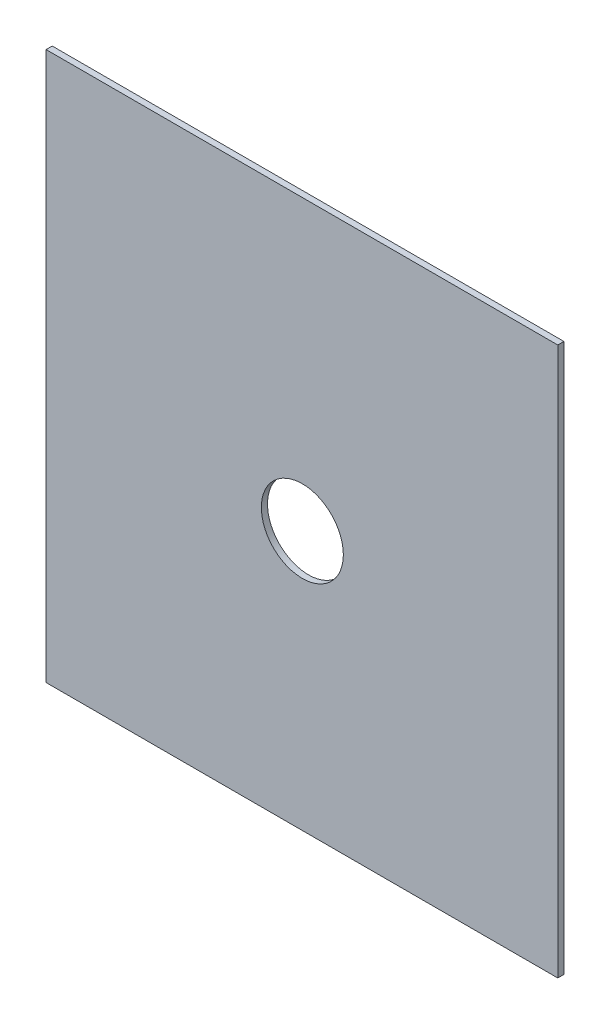
ISO-10303-21;
HEADER;
FILE_DESCRIPTION(('STEP AP214'),'2;1');
FILE_NAME('part.step','',(''),(''),'','','');
FILE_SCHEMA(('AUTOMOTIVE_DESIGN { 1 0 10303 214 1 1 1 1 }'));
ENDSEC;
DATA;
#1=APPLICATION_CONTEXT('core data for automotive mechanical design processes');
#2=APPLICATION_PROTOCOL_DEFINITION('international standard','automotive_design',2000,#1);
#3=PRODUCT_CONTEXT('',#1,'mechanical');
#4=PRODUCT('Part','Part','',(#3));
#5=PRODUCT_RELATED_PRODUCT_CATEGORY('part','',(#4));
#6=PRODUCT_DEFINITION_FORMATION('','',#4);
#7=PRODUCT_DEFINITION_CONTEXT('part definition',#1,'design');
#8=PRODUCT_DEFINITION('design','',#6,#7);
#9=PRODUCT_DEFINITION_SHAPE('','',#8);
#10=(LENGTH_UNIT() NAMED_UNIT(*) SI_UNIT(.MILLI.,.METRE.));
#11=(NAMED_UNIT(*) PLANE_ANGLE_UNIT() SI_UNIT($,.RADIAN.));
#12=(NAMED_UNIT(*) SI_UNIT($,.STERADIAN.) SOLID_ANGLE_UNIT());
#13=UNCERTAINTY_MEASURE_WITH_UNIT(LENGTH_MEASURE(1.E-05),#10,'distance_accuracy_value','');
#14=(GEOMETRIC_REPRESENTATION_CONTEXT(3) GLOBAL_UNCERTAINTY_ASSIGNED_CONTEXT((#13)) GLOBAL_UNIT_ASSIGNED_CONTEXT((#10,
#11,#12)) REPRESENTATION_CONTEXT('',''));
#15=CARTESIAN_POINT('',(0.,0.,0.));
#16=DIRECTION('',(0.,0.,1.));
#17=DIRECTION('',(1.,0.,0.));
#18=AXIS2_PLACEMENT_3D('',#15,#16,#17);
#19=CARTESIAN_POINT('',(0.,0.,3.));
#20=DIRECTION('',(1.,0.,0.));
#21=DIRECTION('',(0.,1.,0.));
#22=AXIS2_PLACEMENT_3D('',#19,#20,#21);
#23=PLANE('',#22);
#24=DIRECTION('',(0.,-1.,0.));
#25=VECTOR('',#24,1.);
#26=CARTESIAN_POINT('',(0.,0.,0.));
#27=LINE('',#26,#25);
#28=CARTESIAN_POINT('',(0.,0.,0.));
#29=VERTEX_POINT('',#28);
#30=CARTESIAN_POINT('',(0.,-267.4,0.));
#31=VERTEX_POINT('',#30);
#32=EDGE_CURVE('E96',#29,#31,#27,.T.);
#33=ORIENTED_EDGE('',*,*,#32,.T.);
#34=DIRECTION('',(0.,0.,-1.));
#35=VECTOR('',#34,1.);
#36=CARTESIAN_POINT('',(0.,-267.4,3.));
#37=LINE('',#36,#35);
#38=CARTESIAN_POINT('',(0.,-267.4,3.));
#39=VERTEX_POINT('',#38);
#40=EDGE_CURVE('E11',#39,#31,#37,.T.);
#41=ORIENTED_EDGE('',*,*,#40,.F.);
#42=DIRECTION('',(0.,-1.,0.));
#43=VECTOR('',#42,1.);
#44=CARTESIAN_POINT('',(0.,0.,3.));
#45=LINE('',#44,#43);
#46=CARTESIAN_POINT('',(0.,0.,3.));
#47=VERTEX_POINT('',#46);
#48=EDGE_CURVE('E84',#47,#39,#45,.T.);
#49=ORIENTED_EDGE('',*,*,#48,.F.);
#50=DIRECTION('',(0.,0.,-1.));
#51=VECTOR('',#50,1.);
#52=CARTESIAN_POINT('',(0.,0.,3.));
#53=LINE('',#52,#51);
#54=EDGE_CURVE('E92',#47,#29,#53,.T.);
#55=ORIENTED_EDGE('',*,*,#54,.T.);
#56=EDGE_LOOP('',(#33,#41,#49,#55));
#57=FACE_BOUND('',#56,.T.);
#58=ADVANCED_FACE('F33',(#57),#23,.F.);
#59=CARTESIAN_POINT('',(0.,-267.4,3.));
#60=DIRECTION('',(0.,1.,0.));
#61=DIRECTION('',(0.,0.,1.));
#62=AXIS2_PLACEMENT_3D('',#59,#60,#61);
#63=PLANE('',#62);
#64=DIRECTION('',(1.,0.,0.));
#65=VECTOR('',#64,1.);
#66=CARTESIAN_POINT('',(0.,-267.4,0.));
#67=LINE('',#66,#65);
#68=CARTESIAN_POINT('',(249.6,-267.4,0.));
#69=VERTEX_POINT('',#68);
#70=EDGE_CURVE('E88',#31,#69,#67,.T.);
#71=ORIENTED_EDGE('',*,*,#70,.T.);
#72=DIRECTION('',(0.,0.,-1.));
#73=VECTOR('',#72,1.);
#74=CARTESIAN_POINT('',(249.6,-267.4,3.));
#75=LINE('',#74,#73);
#76=CARTESIAN_POINT('',(249.6,-267.4,3.));
#77=VERTEX_POINT('',#76);
#78=EDGE_CURVE('E41',#77,#69,#75,.T.);
#79=ORIENTED_EDGE('',*,*,#78,.F.);
#80=DIRECTION('',(1.,0.,0.));
#81=VECTOR('',#80,1.);
#82=CARTESIAN_POINT('',(0.,-267.4,3.));
#83=LINE('',#82,#81);
#84=EDGE_CURVE('E79',#39,#77,#83,.T.);
#85=ORIENTED_EDGE('',*,*,#84,.F.);
#86=ORIENTED_EDGE('',*,*,#40,.T.);
#87=EDGE_LOOP('',(#71,#79,#85,#86));
#88=FACE_BOUND('',#87,.T.);
#89=ADVANCED_FACE('F87',(#88),#63,.F.);
#90=CARTESIAN_POINT('',(249.6,0.,3.));
#91=DIRECTION('',(-1.,0.,0.));
#92=DIRECTION('',(0.,-1.,0.));
#93=AXIS2_PLACEMENT_3D('',#90,#91,#92);
#94=PLANE('',#93);
#95=DIRECTION('',(0.,1.,0.));
#96=VECTOR('',#95,1.);
#97=CARTESIAN_POINT('',(249.6,0.,0.));
#98=LINE('',#97,#96);
#99=CARTESIAN_POINT('',(249.6,0.,0.));
#100=VERTEX_POINT('',#99);
#101=EDGE_CURVE('E66',#69,#100,#98,.T.);
#102=ORIENTED_EDGE('',*,*,#101,.T.);
#103=DIRECTION('',(0.,0.,-1.));
#104=VECTOR('',#103,1.);
#105=CARTESIAN_POINT('',(249.6,0.,3.));
#106=LINE('',#105,#104);
#107=CARTESIAN_POINT('',(249.6,0.,3.));
#108=VERTEX_POINT('',#107);
#109=EDGE_CURVE('E89',#108,#100,#106,.T.);
#110=ORIENTED_EDGE('',*,*,#109,.F.);
#111=DIRECTION('',(0.,1.,0.));
#112=VECTOR('',#111,1.);
#113=CARTESIAN_POINT('',(249.6,0.,3.));
#114=LINE('',#113,#112);
#115=EDGE_CURVE('E82',#77,#108,#114,.T.);
#116=ORIENTED_EDGE('',*,*,#115,.F.);
#117=ORIENTED_EDGE('',*,*,#78,.T.);
#118=EDGE_LOOP('',(#102,#110,#116,#117));
#119=FACE_BOUND('',#118,.T.);
#120=ADVANCED_FACE('F90',(#119),#94,.F.);
#121=CARTESIAN_POINT('',(0.,0.,3.));
#122=DIRECTION('',(0.,-1.,0.));
#123=DIRECTION('',(0.,0.,-1.));
#124=AXIS2_PLACEMENT_3D('',#121,#122,#123);
#125=PLANE('',#124);
#126=DIRECTION('',(-1.,0.,0.));
#127=VECTOR('',#126,1.);
#128=CARTESIAN_POINT('',(0.,0.,0.));
#129=LINE('',#128,#127);
#130=EDGE_CURVE('E72',#100,#29,#129,.T.);
#131=ORIENTED_EDGE('',*,*,#130,.T.);
#132=ORIENTED_EDGE('',*,*,#54,.F.);
#133=DIRECTION('',(-1.,0.,0.));
#134=VECTOR('',#133,1.);
#135=CARTESIAN_POINT('',(0.,0.,3.));
#136=LINE('',#135,#134);
#137=EDGE_CURVE('E49',#108,#47,#136,.T.);
#138=ORIENTED_EDGE('',*,*,#137,.F.);
#139=ORIENTED_EDGE('',*,*,#109,.T.);
#140=EDGE_LOOP('',(#131,#132,#138,#139));
#141=FACE_BOUND('',#140,.T.);
#142=ADVANCED_FACE('F104',(#141),#125,.F.);
#143=CARTESIAN_POINT('',(0.,0.,3.));
#144=DIRECTION('',(0.,0.,1.));
#145=DIRECTION('',(1.,0.,0.));
#146=AXIS2_PLACEMENT_3D('',#143,#144,#145);
#147=PLANE('',#146);
#148=CARTESIAN_POINT('',(125.,-140.910978413468,3.));
#149=DIRECTION('',(0.,0.,1.));
#150=DIRECTION('',(1.,0.,0.));
#151=AXIS2_PLACEMENT_3D('',#148,#149,#150);
#152=CIRCLE('',#151,20.);
#153=CARTESIAN_POINT('',(145.,-140.910978413468,3.));
#154=VERTEX_POINT('',#153);
#155=EDGE_CURVE('E110',#154,#154,#152,.T.);
#156=ORIENTED_EDGE('',*,*,#155,.F.);
#157=EDGE_LOOP('',(#156));
#158=FACE_BOUND('',#157,.T.);
#159=ORIENTED_EDGE('',*,*,#48,.T.);
#160=ORIENTED_EDGE('',*,*,#84,.T.);
#161=ORIENTED_EDGE('',*,*,#115,.T.);
#162=ORIENTED_EDGE('',*,*,#137,.T.);
#163=EDGE_LOOP('',(#159,#160,#161,#162));
#164=FACE_BOUND('',#163,.T.);
#165=ADVANCED_FACE('F80',(#158,#164),#147,.T.);
#166=CARTESIAN_POINT('',(0.,0.,0.));
#167=DIRECTION('',(0.,0.,1.));
#168=DIRECTION('',(1.,0.,0.));
#169=AXIS2_PLACEMENT_3D('',#166,#167,#168);
#170=PLANE('',#169);
#171=CARTESIAN_POINT('',(125.,-140.910978413468,0.));
#172=DIRECTION('',(0.,0.,1.));
#173=DIRECTION('',(1.,0.,0.));
#174=AXIS2_PLACEMENT_3D('',#171,#172,#173);
#175=CIRCLE('',#174,20.);
#176=CARTESIAN_POINT('',(145.,-140.910978413468,0.));
#177=VERTEX_POINT('',#176);
#178=EDGE_CURVE('E99',#177,#177,#175,.T.);
#179=ORIENTED_EDGE('',*,*,#178,.T.);
#180=EDGE_LOOP('',(#179));
#181=FACE_BOUND('',#180,.T.);
#182=ORIENTED_EDGE('',*,*,#32,.F.);
#183=ORIENTED_EDGE('',*,*,#130,.F.);
#184=ORIENTED_EDGE('',*,*,#101,.F.);
#185=ORIENTED_EDGE('',*,*,#70,.F.);
#186=EDGE_LOOP('',(#182,#183,#184,#185));
#187=FACE_BOUND('',#186,.T.);
#188=ADVANCED_FACE('F107',(#181,#187),#170,.F.);
#189=CARTESIAN_POINT('',(125.,-140.910978413468,0.));
#190=DIRECTION('',(0.,0.,1.));
#191=DIRECTION('',(1.,0.,0.));
#192=AXIS2_PLACEMENT_3D('',#189,#190,#191);
#193=CYLINDRICAL_SURFACE('',#192,20.);
#194=ORIENTED_EDGE('',*,*,#178,.F.);
#195=EDGE_LOOP('',(#194));
#196=FACE_BOUND('',#195,.T.);
#197=ORIENTED_EDGE('',*,*,#155,.T.);
#198=EDGE_LOOP('',(#197));
#199=FACE_BOUND('',#198,.T.);
#200=ADVANCED_FACE('F117',(#196,#199),#193,.F.);
#201=CLOSED_SHELL('',(#58,#89,#120,#142,#165,#188,#200));
#202=MANIFOLD_SOLID_BREP('B2',#201);
#203=ADVANCED_BREP_SHAPE_REPRESENTATION('',(#18,#202),#14);
#204=SHAPE_DEFINITION_REPRESENTATION(#9,#203);
ENDSEC;
END-ISO-10303-21;
